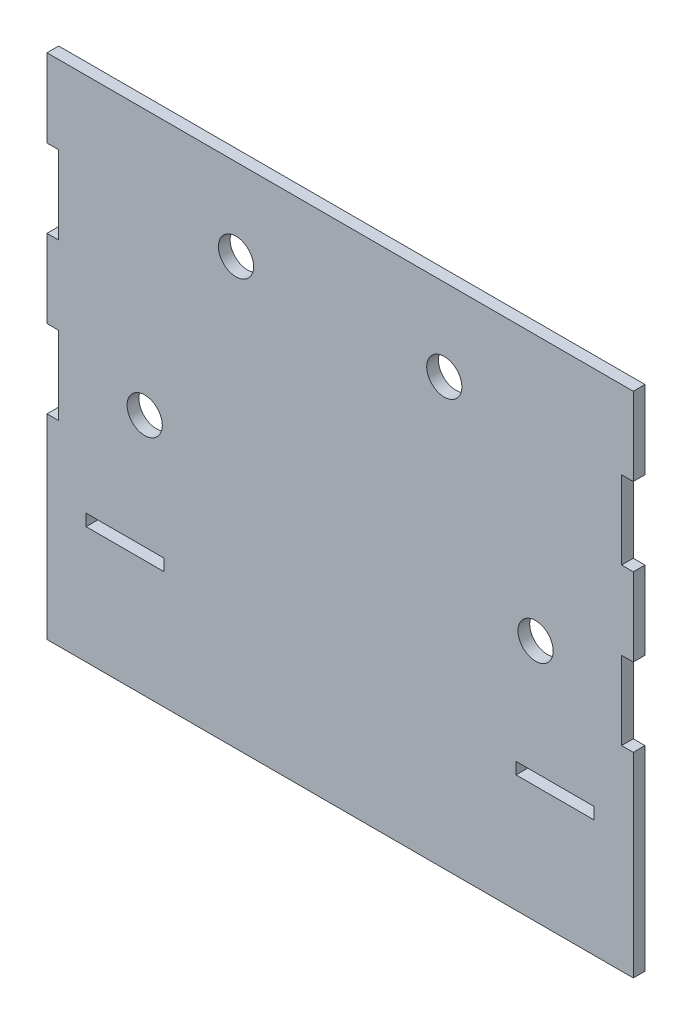
ISO-10303-21;
HEADER;
FILE_DESCRIPTION(('STEP AP214'),'2;1');
FILE_NAME('part.step','',(''),(''),'','','');
FILE_SCHEMA(('AUTOMOTIVE_DESIGN { 1 0 10303 214 1 1 1 1 }'));
ENDSEC;
DATA;
#1=APPLICATION_CONTEXT('core data for automotive mechanical design processes');
#2=APPLICATION_PROTOCOL_DEFINITION('international standard','automotive_design',2000,#1);
#3=PRODUCT_CONTEXT('',#1,'mechanical');
#4=PRODUCT('Part','Part','',(#3));
#5=PRODUCT_RELATED_PRODUCT_CATEGORY('part','',(#4));
#6=PRODUCT_DEFINITION_FORMATION('','',#4);
#7=PRODUCT_DEFINITION_CONTEXT('part definition',#1,'design');
#8=PRODUCT_DEFINITION('design','',#6,#7);
#9=PRODUCT_DEFINITION_SHAPE('','',#8);
#10=(LENGTH_UNIT() NAMED_UNIT(*) SI_UNIT(.MILLI.,.METRE.));
#11=(NAMED_UNIT(*) PLANE_ANGLE_UNIT() SI_UNIT($,.RADIAN.));
#12=(NAMED_UNIT(*) SI_UNIT($,.STERADIAN.) SOLID_ANGLE_UNIT());
#13=UNCERTAINTY_MEASURE_WITH_UNIT(LENGTH_MEASURE(1.E-05),#10,'distance_accuracy_value','');
#14=(GEOMETRIC_REPRESENTATION_CONTEXT(3) GLOBAL_UNCERTAINTY_ASSIGNED_CONTEXT((#13)) GLOBAL_UNIT_ASSIGNED_CONTEXT((#10,
#11,#12)) REPRESENTATION_CONTEXT('',''));
#15=CARTESIAN_POINT('',(0.,0.,0.));
#16=DIRECTION('',(0.,0.,1.));
#17=DIRECTION('',(1.,0.,0.));
#18=AXIS2_PLACEMENT_3D('',#15,#16,#17);
#19=CARTESIAN_POINT('',(75.,-50.,3.));
#20=DIRECTION('',(-1.,0.,0.));
#21=DIRECTION('',(0.,0.,1.));
#22=AXIS2_PLACEMENT_3D('',#19,#20,#21);
#23=PLANE('',#22);
#24=DIRECTION('',(0.,1.,0.));
#25=VECTOR('',#24,1.);
#26=CARTESIAN_POINT('',(75.,-50.,0.));
#27=LINE('',#26,#25);
#28=CARTESIAN_POINT('',(75.,-80.,0.));
#29=VERTEX_POINT('',#28);
#30=CARTESIAN_POINT('',(75.,-30.,0.));
#31=VERTEX_POINT('',#30);
#32=EDGE_CURVE('E246',#29,#31,#27,.T.);
#33=ORIENTED_EDGE('',*,*,#32,.T.);
#34=DIRECTION('',(0.,0.,1.));
#35=VECTOR('',#34,1.);
#36=CARTESIAN_POINT('',(75.,-30.,0.));
#37=LINE('',#36,#35);
#38=CARTESIAN_POINT('',(75.,-30.,3.));
#39=VERTEX_POINT('',#38);
#40=EDGE_CURVE('E333',#31,#39,#37,.T.);
#41=ORIENTED_EDGE('',*,*,#40,.T.);
#42=DIRECTION('',(0.,1.,0.));
#43=VECTOR('',#42,1.);
#44=CARTESIAN_POINT('',(75.,-50.,3.));
#45=LINE('',#44,#43);
#46=CARTESIAN_POINT('',(75.,-80.,3.));
#47=VERTEX_POINT('',#46);
#48=EDGE_CURVE('E424',#47,#39,#45,.T.);
#49=ORIENTED_EDGE('',*,*,#48,.F.);
#50=DIRECTION('',(0.,0.,1.));
#51=VECTOR('',#50,1.);
#52=CARTESIAN_POINT('',(75.,-80.,3.));
#53=LINE('',#52,#51);
#54=EDGE_CURVE('E250',#29,#47,#53,.T.);
#55=ORIENTED_EDGE('',*,*,#54,.F.);
#56=EDGE_LOOP('',(#33,#41,#49,#55));
#57=FACE_BOUND('',#56,.T.);
#58=ADVANCED_FACE('F39',(#57),#23,.F.);
#59=CARTESIAN_POINT('',(75.,-10.,3.));
#60=VERTEX_POINT('',#59);
#61=CARTESIAN_POINT('',(75.,9.99999999999999,3.));
#62=VERTEX_POINT('',#61);
#63=EDGE_CURVE('E428',#60,#62,#45,.T.);
#64=ORIENTED_EDGE('',*,*,#63,.F.);
#65=DIRECTION('',(0.,0.,1.));
#66=VECTOR('',#65,1.);
#67=CARTESIAN_POINT('',(75.,-10.,0.));
#68=LINE('',#67,#66);
#69=CARTESIAN_POINT('',(75.,-10.,0.));
#70=VERTEX_POINT('',#69);
#71=EDGE_CURVE('E326',#70,#60,#68,.T.);
#72=ORIENTED_EDGE('',*,*,#71,.F.);
#73=CARTESIAN_POINT('',(75.,9.99999999999999,0.));
#74=VERTEX_POINT('',#73);
#75=EDGE_CURVE('E437',#70,#74,#27,.T.);
#76=ORIENTED_EDGE('',*,*,#75,.T.);
#77=DIRECTION('',(0.,0.,1.));
#78=VECTOR('',#77,1.);
#79=CARTESIAN_POINT('',(75.,9.99999999999999,0.));
#80=LINE('',#79,#78);
#81=EDGE_CURVE('E415',#74,#62,#80,.T.);
#82=ORIENTED_EDGE('',*,*,#81,.T.);
#83=EDGE_LOOP('',(#64,#72,#76,#82));
#84=FACE_BOUND('',#83,.T.);
#85=ADVANCED_FACE('F491',(#84),#23,.F.);
#86=CARTESIAN_POINT('',(-75.,-50.,3.));
#87=DIRECTION('',(1.,0.,0.));
#88=DIRECTION('',(0.,0.,-1.));
#89=AXIS2_PLACEMENT_3D('',#86,#87,#88);
#90=PLANE('',#89);
#91=DIRECTION('',(0.,-1.,0.));
#92=VECTOR('',#91,1.);
#93=CARTESIAN_POINT('',(-75.,-50.,0.));
#94=LINE('',#93,#92);
#95=CARTESIAN_POINT('',(-75.,50.,0.));
#96=VERTEX_POINT('',#95);
#97=CARTESIAN_POINT('',(-75.,30.,0.));
#98=VERTEX_POINT('',#97);
#99=EDGE_CURVE('E239',#96,#98,#94,.T.);
#100=ORIENTED_EDGE('',*,*,#99,.T.);
#101=DIRECTION('',(0.,0.,1.));
#102=VECTOR('',#101,1.);
#103=CARTESIAN_POINT('',(-75.,30.,0.));
#104=LINE('',#103,#102);
#105=CARTESIAN_POINT('',(-75.,30.,3.));
#106=VERTEX_POINT('',#105);
#107=EDGE_CURVE('E376',#98,#106,#104,.T.);
#108=ORIENTED_EDGE('',*,*,#107,.T.);
#109=DIRECTION('',(0.,-1.,0.));
#110=VECTOR('',#109,1.);
#111=CARTESIAN_POINT('',(-75.,-50.,3.));
#112=LINE('',#111,#110);
#113=CARTESIAN_POINT('',(-75.,50.,3.));
#114=VERTEX_POINT('',#113);
#115=EDGE_CURVE('E432',#114,#106,#112,.T.);
#116=ORIENTED_EDGE('',*,*,#115,.F.);
#117=DIRECTION('',(0.,0.,-1.));
#118=VECTOR('',#117,1.);
#119=CARTESIAN_POINT('',(-75.,50.,3.));
#120=LINE('',#119,#118);
#121=EDGE_CURVE('E48',#114,#96,#120,.T.);
#122=ORIENTED_EDGE('',*,*,#121,.T.);
#123=EDGE_LOOP('',(#100,#108,#116,#122));
#124=FACE_BOUND('',#123,.T.);
#125=ADVANCED_FACE('F496',(#124),#90,.F.);
#126=CARTESIAN_POINT('',(-75.,9.99999999999999,3.));
#127=VERTEX_POINT('',#126);
#128=CARTESIAN_POINT('',(-75.,-10.,3.));
#129=VERTEX_POINT('',#128);
#130=EDGE_CURVE('E435',#127,#129,#112,.T.);
#131=ORIENTED_EDGE('',*,*,#130,.F.);
#132=DIRECTION('',(0.,0.,1.));
#133=VECTOR('',#132,1.);
#134=CARTESIAN_POINT('',(-75.,9.99999999999999,0.));
#135=LINE('',#134,#133);
#136=CARTESIAN_POINT('',(-75.,9.99999999999999,0.));
#137=VERTEX_POINT('',#136);
#138=EDGE_CURVE('E379',#137,#127,#135,.T.);
#139=ORIENTED_EDGE('',*,*,#138,.F.);
#140=CARTESIAN_POINT('',(-75.,-10.,0.));
#141=VERTEX_POINT('',#140);
#142=EDGE_CURVE('E236',#137,#141,#94,.T.);
#143=ORIENTED_EDGE('',*,*,#142,.T.);
#144=DIRECTION('',(0.,0.,1.));
#145=VECTOR('',#144,1.);
#146=CARTESIAN_POINT('',(-75.,-10.,0.));
#147=LINE('',#146,#145);
#148=EDGE_CURVE('E302',#141,#129,#147,.T.);
#149=ORIENTED_EDGE('',*,*,#148,.T.);
#150=EDGE_LOOP('',(#131,#139,#143,#149));
#151=FACE_BOUND('',#150,.T.);
#152=ADVANCED_FACE('F500',(#151),#90,.F.);
#153=CARTESIAN_POINT('',(75.,30.,3.));
#154=VERTEX_POINT('',#153);
#155=CARTESIAN_POINT('',(75.,50.,3.));
#156=VERTEX_POINT('',#155);
#157=EDGE_CURVE('E429',#154,#156,#45,.T.);
#158=ORIENTED_EDGE('',*,*,#157,.F.);
#159=DIRECTION('',(0.,0.,1.));
#160=VECTOR('',#159,1.);
#161=CARTESIAN_POINT('',(75.,30.,0.));
#162=LINE('',#161,#160);
#163=CARTESIAN_POINT('',(75.,30.,0.));
#164=VERTEX_POINT('',#163);
#165=EDGE_CURVE('E408',#164,#154,#162,.T.);
#166=ORIENTED_EDGE('',*,*,#165,.F.);
#167=CARTESIAN_POINT('',(75.,50.,0.));
#168=VERTEX_POINT('',#167);
#169=EDGE_CURVE('E418',#164,#168,#27,.T.);
#170=ORIENTED_EDGE('',*,*,#169,.T.);
#171=DIRECTION('',(0.,0.,-1.));
#172=VECTOR('',#171,1.);
#173=CARTESIAN_POINT('',(75.,50.,3.));
#174=LINE('',#173,#172);
#175=EDGE_CURVE('E11',#156,#168,#174,.T.);
#176=ORIENTED_EDGE('',*,*,#175,.F.);
#177=EDGE_LOOP('',(#158,#166,#170,#176));
#178=FACE_BOUND('',#177,.T.);
#179=ADVANCED_FACE('F41',(#178),#23,.F.);
#180=CARTESIAN_POINT('',(-75.,50.,3.));
#181=DIRECTION('',(0.,-1.,0.));
#182=DIRECTION('',(0.,0.,-1.));
#183=AXIS2_PLACEMENT_3D('',#180,#181,#182);
#184=PLANE('',#183);
#185=DIRECTION('',(-1.,0.,0.));
#186=VECTOR('',#185,1.);
#187=CARTESIAN_POINT('',(-75.,50.,0.));
#188=LINE('',#187,#186);
#189=EDGE_CURVE('E237',#168,#96,#188,.T.);
#190=ORIENTED_EDGE('',*,*,#189,.T.);
#191=ORIENTED_EDGE('',*,*,#121,.F.);
#192=DIRECTION('',(-1.,0.,0.));
#193=VECTOR('',#192,1.);
#194=CARTESIAN_POINT('',(-75.,50.,3.));
#195=LINE('',#194,#193);
#196=EDGE_CURVE('E427',#156,#114,#195,.T.);
#197=ORIENTED_EDGE('',*,*,#196,.F.);
#198=ORIENTED_EDGE('',*,*,#175,.T.);
#199=EDGE_LOOP('',(#190,#191,#197,#198));
#200=FACE_BOUND('',#199,.T.);
#201=ADVANCED_FACE('F499',(#200),#184,.F.);
#202=CARTESIAN_POINT('',(-75.,-30.,3.));
#203=VERTEX_POINT('',#202);
#204=CARTESIAN_POINT('',(-75.,-80.,3.));
#205=VERTEX_POINT('',#204);
#206=EDGE_CURVE('E431',#203,#205,#112,.T.);
#207=ORIENTED_EDGE('',*,*,#206,.F.);
#208=DIRECTION('',(0.,0.,1.));
#209=VECTOR('',#208,1.);
#210=CARTESIAN_POINT('',(-75.,-30.,0.));
#211=LINE('',#210,#209);
#212=CARTESIAN_POINT('',(-75.,-30.,0.));
#213=VERTEX_POINT('',#212);
#214=EDGE_CURVE('E233',#213,#203,#211,.T.);
#215=ORIENTED_EDGE('',*,*,#214,.F.);
#216=CARTESIAN_POINT('',(-75.,-80.,0.));
#217=VERTEX_POINT('',#216);
#218=EDGE_CURVE('E227',#213,#217,#94,.T.);
#219=ORIENTED_EDGE('',*,*,#218,.T.);
#220=DIRECTION('',(0.,0.,-1.));
#221=VECTOR('',#220,1.);
#222=CARTESIAN_POINT('',(-75.,-80.,3.));
#223=LINE('',#222,#221);
#224=EDGE_CURVE('E232',#205,#217,#223,.T.);
#225=ORIENTED_EDGE('',*,*,#224,.F.);
#226=EDGE_LOOP('',(#207,#215,#219,#225));
#227=FACE_BOUND('',#226,.T.);
#228=ADVANCED_FACE('F230',(#227),#90,.F.);
#229=CARTESIAN_POINT('',(0.,0.,3.));
#230=DIRECTION('',(0.,0.,-1.));
#231=DIRECTION('',(-1.,0.,0.));
#232=AXIS2_PLACEMENT_3D('',#229,#230,#231);
#233=PLANE('',#232);
#234=CARTESIAN_POINT('',(-26.6440677966097,29.0267849830182,3.));
#235=DIRECTION('',(0.,0.,-1.));
#236=DIRECTION('',(-1.,0.,0.));
#237=AXIS2_PLACEMENT_3D('',#234,#235,#236);
#238=CIRCLE('',#237,4.49999999999964);
#239=CARTESIAN_POINT('',(-31.1440677966093,29.0267849830182,3.));
#240=VERTEX_POINT('',#239);
#241=EDGE_CURVE('E451',#240,#240,#238,.T.);
#242=ORIENTED_EDGE('',*,*,#241,.T.);
#243=EDGE_LOOP('',(#242));
#244=FACE_BOUND('',#243,.T.);
#245=CARTESIAN_POINT('',(26.6440677966106,29.0267849830176,3.));
#246=DIRECTION('',(0.,0.,-1.));
#247=DIRECTION('',(-1.,0.,0.));
#248=AXIS2_PLACEMENT_3D('',#245,#246,#247);
#249=CIRCLE('',#248,4.49999999999965);
#250=CARTESIAN_POINT('',(22.144067796611,29.0267849830176,3.));
#251=VERTEX_POINT('',#250);
#252=EDGE_CURVE('E455',#251,#251,#249,.T.);
#253=ORIENTED_EDGE('',*,*,#252,.T.);
#254=EDGE_LOOP('',(#253));
#255=FACE_BOUND('',#254,.T.);
#256=CARTESIAN_POINT('',(49.9999999999923,-17.807715926452,3.));
#257=DIRECTION('',(0.,0.,1.));
#258=DIRECTION('',(1.,0.,0.));
#259=AXIS2_PLACEMENT_3D('',#256,#257,#258);
#260=CIRCLE('',#259,4.4999999999935);
#261=CARTESIAN_POINT('',(54.4999999999858,-17.807715926452,3.));
#262=VERTEX_POINT('',#261);
#263=EDGE_CURVE('E443',#262,#262,#260,.T.);
#264=ORIENTED_EDGE('',*,*,#263,.F.);
#265=EDGE_LOOP('',(#264));
#266=FACE_BOUND('',#265,.T.);
#267=CARTESIAN_POINT('',(-50.0000000000077,-17.8077159264507,3.));
#268=DIRECTION('',(0.,0.,1.));
#269=DIRECTION('',(1.,0.,0.));
#270=AXIS2_PLACEMENT_3D('',#267,#268,#269);
#271=CIRCLE('',#270,4.5);
#272=CARTESIAN_POINT('',(-45.5000000000077,-17.8077159264507,3.));
#273=VERTEX_POINT('',#272);
#274=EDGE_CURVE('E262',#273,#273,#271,.T.);
#275=ORIENTED_EDGE('',*,*,#274,.F.);
#276=EDGE_LOOP('',(#275));
#277=FACE_BOUND('',#276,.T.);
#278=DIRECTION('',(-1.,0.,0.));
#279=VECTOR('',#278,1.);
#280=CARTESIAN_POINT('',(-75.,-80.,3.));
#281=LINE('',#280,#279);
#282=EDGE_CURVE('E255',#47,#205,#281,.T.);
#283=ORIENTED_EDGE('',*,*,#282,.F.);
#284=ORIENTED_EDGE('',*,*,#48,.T.);
#285=DIRECTION('',(1.,0.,0.));
#286=VECTOR('',#285,1.);
#287=CARTESIAN_POINT('',(72.,-30.,3.));
#288=LINE('',#287,#286);
#289=CARTESIAN_POINT('',(72.,-30.,3.));
#290=VERTEX_POINT('',#289);
#291=EDGE_CURVE('E337',#290,#39,#288,.T.);
#292=ORIENTED_EDGE('',*,*,#291,.F.);
#293=DIRECTION('',(0.,-1.,0.));
#294=VECTOR('',#293,1.);
#295=CARTESIAN_POINT('',(72.,-10.,3.));
#296=LINE('',#295,#294);
#297=CARTESIAN_POINT('',(72.,-10.,3.));
#298=VERTEX_POINT('',#297);
#299=EDGE_CURVE('E339',#298,#290,#296,.T.);
#300=ORIENTED_EDGE('',*,*,#299,.F.);
#301=DIRECTION('',(-1.,0.,0.));
#302=VECTOR('',#301,1.);
#303=CARTESIAN_POINT('',(75.,-10.,3.));
#304=LINE('',#303,#302);
#305=EDGE_CURVE('E343',#60,#298,#304,.T.);
#306=ORIENTED_EDGE('',*,*,#305,.F.);
#307=ORIENTED_EDGE('',*,*,#63,.T.);
#308=DIRECTION('',(1.,0.,0.));
#309=VECTOR('',#308,1.);
#310=CARTESIAN_POINT('',(72.,10.,3.));
#311=LINE('',#310,#309);
#312=CARTESIAN_POINT('',(72.,10.,3.));
#313=VERTEX_POINT('',#312);
#314=EDGE_CURVE('E402',#313,#62,#311,.T.);
#315=ORIENTED_EDGE('',*,*,#314,.F.);
#316=DIRECTION('',(0.,-1.,0.));
#317=VECTOR('',#316,1.);
#318=CARTESIAN_POINT('',(72.,30.,3.));
#319=LINE('',#318,#317);
#320=CARTESIAN_POINT('',(72.,30.,3.));
#321=VERTEX_POINT('',#320);
#322=EDGE_CURVE('E411',#321,#313,#319,.T.);
#323=ORIENTED_EDGE('',*,*,#322,.F.);
#324=DIRECTION('',(-1.,0.,0.));
#325=VECTOR('',#324,1.);
#326=CARTESIAN_POINT('',(75.,30.,3.));
#327=LINE('',#326,#325);
#328=EDGE_CURVE('E346',#154,#321,#327,.T.);
#329=ORIENTED_EDGE('',*,*,#328,.F.);
#330=ORIENTED_EDGE('',*,*,#157,.T.);
#331=ORIENTED_EDGE('',*,*,#196,.T.);
#332=ORIENTED_EDGE('',*,*,#115,.T.);
#333=DIRECTION('',(-1.,0.,0.));
#334=VECTOR('',#333,1.);
#335=CARTESIAN_POINT('',(-75.,30.,3.));
#336=LINE('',#335,#334);
#337=CARTESIAN_POINT('',(-72.,30.,3.));
#338=VERTEX_POINT('',#337);
#339=EDGE_CURVE('E311',#338,#106,#336,.T.);
#340=ORIENTED_EDGE('',*,*,#339,.F.);
#341=DIRECTION('',(0.,1.,0.));
#342=VECTOR('',#341,1.);
#343=CARTESIAN_POINT('',(-72.,30.,3.));
#344=LINE('',#343,#342);
#345=CARTESIAN_POINT('',(-72.,10.,3.));
#346=VERTEX_POINT('',#345);
#347=EDGE_CURVE('E384',#346,#338,#344,.T.);
#348=ORIENTED_EDGE('',*,*,#347,.F.);
#349=DIRECTION('',(1.,0.,0.));
#350=VECTOR('',#349,1.);
#351=CARTESIAN_POINT('',(-72.,10.,3.));
#352=LINE('',#351,#350);
#353=EDGE_CURVE('E387',#127,#346,#352,.T.);
#354=ORIENTED_EDGE('',*,*,#353,.F.);
#355=ORIENTED_EDGE('',*,*,#130,.T.);
#356=DIRECTION('',(-1.,0.,0.));
#357=VECTOR('',#356,1.);
#358=CARTESIAN_POINT('',(-75.,-10.,3.));
#359=LINE('',#358,#357);
#360=CARTESIAN_POINT('',(-72.,-10.,3.));
#361=VERTEX_POINT('',#360);
#362=EDGE_CURVE('E283',#361,#129,#359,.T.);
#363=ORIENTED_EDGE('',*,*,#362,.F.);
#364=DIRECTION('',(0.,1.,0.));
#365=VECTOR('',#364,1.);
#366=CARTESIAN_POINT('',(-72.,-10.,3.));
#367=LINE('',#366,#365);
#368=CARTESIAN_POINT('',(-72.,-30.,3.));
#369=VERTEX_POINT('',#368);
#370=EDGE_CURVE('E312',#369,#361,#367,.T.);
#371=ORIENTED_EDGE('',*,*,#370,.F.);
#372=DIRECTION('',(1.,0.,0.));
#373=VECTOR('',#372,1.);
#374=CARTESIAN_POINT('',(-72.,-30.,3.));
#375=LINE('',#374,#373);
#376=EDGE_CURVE('E315',#203,#369,#375,.T.);
#377=ORIENTED_EDGE('',*,*,#376,.F.);
#378=ORIENTED_EDGE('',*,*,#206,.T.);
#379=EDGE_LOOP('',(#283,#284,#292,#300,#306,#307,#315,#323,#329,#330,#331,#332,#340,#348,#354,
#355,#363,#371,#377,#378));
#380=FACE_BOUND('',#379,.T.);
#381=DIRECTION('',(-1.,0.,0.));
#382=VECTOR('',#381,1.);
#383=CARTESIAN_POINT('',(-75.,-50.,3.));
#384=LINE('',#383,#382);
#385=CARTESIAN_POINT('',(65.,-50.,3.));
#386=VERTEX_POINT('',#385);
#387=CARTESIAN_POINT('',(45.,-50.,3.));
#388=VERTEX_POINT('',#387);
#389=EDGE_CURVE('E256',#386,#388,#384,.T.);
#390=ORIENTED_EDGE('',*,*,#389,.T.);
#391=DIRECTION('',(0.,-1.,0.));
#392=VECTOR('',#391,1.);
#393=CARTESIAN_POINT('',(45.,-50.,3.));
#394=LINE('',#393,#392);
#395=CARTESIAN_POINT('',(45.,-47.,3.));
#396=VERTEX_POINT('',#395);
#397=EDGE_CURVE('E291',#396,#388,#394,.T.);
#398=ORIENTED_EDGE('',*,*,#397,.F.);
#399=DIRECTION('',(-1.,0.,0.));
#400=VECTOR('',#399,1.);
#401=CARTESIAN_POINT('',(45.,-47.,3.));
#402=LINE('',#401,#400);
#403=CARTESIAN_POINT('',(65.,-47.,3.));
#404=VERTEX_POINT('',#403);
#405=EDGE_CURVE('E284',#404,#396,#402,.T.);
#406=ORIENTED_EDGE('',*,*,#405,.F.);
#407=DIRECTION('',(0.,1.,0.));
#408=VECTOR('',#407,1.);
#409=CARTESIAN_POINT('',(65.,-50.,3.));
#410=LINE('',#409,#408);
#411=EDGE_CURVE('E287',#386,#404,#410,.T.);
#412=ORIENTED_EDGE('',*,*,#411,.F.);
#413=EDGE_LOOP('',(#390,#398,#406,#412));
#414=FACE_BOUND('',#413,.T.);
#415=DIRECTION('',(0.,1.,0.));
#416=VECTOR('',#415,1.);
#417=CARTESIAN_POINT('',(-45.,-50.,3.));
#418=LINE('',#417,#416);
#419=CARTESIAN_POINT('',(-45.,-50.,3.));
#420=VERTEX_POINT('',#419);
#421=CARTESIAN_POINT('',(-45.,-47.,3.));
#422=VERTEX_POINT('',#421);
#423=EDGE_CURVE('E364',#420,#422,#418,.T.);
#424=ORIENTED_EDGE('',*,*,#423,.F.);
#425=CARTESIAN_POINT('',(-65.,-50.,3.));
#426=VERTEX_POINT('',#425);
#427=EDGE_CURVE('E259',#420,#426,#384,.T.);
#428=ORIENTED_EDGE('',*,*,#427,.T.);
#429=DIRECTION('',(0.,-1.,0.));
#430=VECTOR('',#429,1.);
#431=CARTESIAN_POINT('',(-65.,-50.,3.));
#432=LINE('',#431,#430);
#433=CARTESIAN_POINT('',(-65.,-47.,3.));
#434=VERTEX_POINT('',#433);
#435=EDGE_CURVE('E336',#434,#426,#432,.T.);
#436=ORIENTED_EDGE('',*,*,#435,.F.);
#437=DIRECTION('',(-1.,0.,0.));
#438=VECTOR('',#437,1.);
#439=CARTESIAN_POINT('',(-65.,-47.,3.));
#440=LINE('',#439,#438);
#441=EDGE_CURVE('E361',#422,#434,#440,.T.);
#442=ORIENTED_EDGE('',*,*,#441,.F.);
#443=EDGE_LOOP('',(#424,#428,#436,#442));
#444=FACE_BOUND('',#443,.T.);
#445=ADVANCED_FACE('F471',(#244,#255,#266,#277,#380,#414,#444),#233,.F.);
#446=CARTESIAN_POINT('',(0.,0.,0.));
#447=DIRECTION('',(0.,0.,-1.));
#448=DIRECTION('',(-1.,0.,0.));
#449=AXIS2_PLACEMENT_3D('',#446,#447,#448);
#450=PLANE('',#449);
#451=CARTESIAN_POINT('',(-26.6440677966097,29.0267849830182,0.));
#452=DIRECTION('',(0.,0.,-1.));
#453=DIRECTION('',(-1.,0.,0.));
#454=AXIS2_PLACEMENT_3D('',#451,#452,#453);
#455=CIRCLE('',#454,4.49999999999964);
#456=CARTESIAN_POINT('',(-31.1440677966093,29.0267849830182,0.));
#457=VERTEX_POINT('',#456);
#458=EDGE_CURVE('E458',#457,#457,#455,.T.);
#459=ORIENTED_EDGE('',*,*,#458,.F.);
#460=EDGE_LOOP('',(#459));
#461=FACE_BOUND('',#460,.T.);
#462=CARTESIAN_POINT('',(26.6440677966106,29.0267849830176,0.));
#463=DIRECTION('',(0.,0.,-1.));
#464=DIRECTION('',(-1.,0.,0.));
#465=AXIS2_PLACEMENT_3D('',#462,#463,#464);
#466=CIRCLE('',#465,4.49999999999965);
#467=CARTESIAN_POINT('',(22.144067796611,29.0267849830176,0.));
#468=VERTEX_POINT('',#467);
#469=EDGE_CURVE('E459',#468,#468,#466,.T.);
#470=ORIENTED_EDGE('',*,*,#469,.F.);
#471=EDGE_LOOP('',(#470));
#472=FACE_BOUND('',#471,.T.);
#473=CARTESIAN_POINT('',(49.9999999999923,-17.807715926452,0.));
#474=DIRECTION('',(0.,0.,-1.));
#475=DIRECTION('',(-1.,0.,0.));
#476=AXIS2_PLACEMENT_3D('',#473,#474,#475);
#477=CIRCLE('',#476,4.4999999999935);
#478=CARTESIAN_POINT('',(45.4999999999988,-17.807715926452,0.));
#479=VERTEX_POINT('',#478);
#480=EDGE_CURVE('E43',#479,#479,#477,.T.);
#481=ORIENTED_EDGE('',*,*,#480,.F.);
#482=EDGE_LOOP('',(#481));
#483=FACE_BOUND('',#482,.T.);
#484=CARTESIAN_POINT('',(-50.0000000000077,-17.8077159264507,0.));
#485=DIRECTION('',(0.,0.,-1.));
#486=DIRECTION('',(-1.,0.,0.));
#487=AXIS2_PLACEMENT_3D('',#484,#485,#486);
#488=CIRCLE('',#487,4.5);
#489=CARTESIAN_POINT('',(-54.5000000000077,-17.8077159264507,0.));
#490=VERTEX_POINT('',#489);
#491=EDGE_CURVE('E441',#490,#490,#488,.T.);
#492=ORIENTED_EDGE('',*,*,#491,.F.);
#493=EDGE_LOOP('',(#492));
#494=FACE_BOUND('',#493,.T.);
#495=ORIENTED_EDGE('',*,*,#32,.F.);
#496=DIRECTION('',(1.,0.,0.));
#497=VECTOR('',#496,1.);
#498=CARTESIAN_POINT('',(-75.,-80.,0.));
#499=LINE('',#498,#497);
#500=EDGE_CURVE('E241',#217,#29,#499,.T.);
#501=ORIENTED_EDGE('',*,*,#500,.F.);
#502=ORIENTED_EDGE('',*,*,#218,.F.);
#503=DIRECTION('',(1.,0.,0.));
#504=VECTOR('',#503,1.);
#505=CARTESIAN_POINT('',(-72.,-30.,0.));
#506=LINE('',#505,#504);
#507=CARTESIAN_POINT('',(-72.,-30.,0.));
#508=VERTEX_POINT('',#507);
#509=EDGE_CURVE('E322',#213,#508,#506,.T.);
#510=ORIENTED_EDGE('',*,*,#509,.T.);
#511=DIRECTION('',(0.,1.,0.));
#512=VECTOR('',#511,1.);
#513=CARTESIAN_POINT('',(-72.,-10.,0.));
#514=LINE('',#513,#512);
#515=CARTESIAN_POINT('',(-72.,-10.,0.));
#516=VERTEX_POINT('',#515);
#517=EDGE_CURVE('E305',#508,#516,#514,.T.);
#518=ORIENTED_EDGE('',*,*,#517,.T.);
#519=DIRECTION('',(-1.,0.,0.));
#520=VECTOR('',#519,1.);
#521=CARTESIAN_POINT('',(-75.,-10.,0.));
#522=LINE('',#521,#520);
#523=EDGE_CURVE('E316',#516,#141,#522,.T.);
#524=ORIENTED_EDGE('',*,*,#523,.T.);
#525=ORIENTED_EDGE('',*,*,#142,.F.);
#526=DIRECTION('',(1.,0.,0.));
#527=VECTOR('',#526,1.);
#528=CARTESIAN_POINT('',(-72.,10.,0.));
#529=LINE('',#528,#527);
#530=CARTESIAN_POINT('',(-72.,10.,0.));
#531=VERTEX_POINT('',#530);
#532=EDGE_CURVE('E393',#137,#531,#529,.T.);
#533=ORIENTED_EDGE('',*,*,#532,.T.);
#534=DIRECTION('',(0.,1.,0.));
#535=VECTOR('',#534,1.);
#536=CARTESIAN_POINT('',(-72.,30.,0.));
#537=LINE('',#536,#535);
#538=CARTESIAN_POINT('',(-72.,30.,0.));
#539=VERTEX_POINT('',#538);
#540=EDGE_CURVE('E56',#531,#539,#537,.T.);
#541=ORIENTED_EDGE('',*,*,#540,.T.);
#542=DIRECTION('',(-1.,0.,0.));
#543=VECTOR('',#542,1.);
#544=CARTESIAN_POINT('',(-75.,30.,0.));
#545=LINE('',#544,#543);
#546=EDGE_CURVE('E388',#539,#98,#545,.T.);
#547=ORIENTED_EDGE('',*,*,#546,.T.);
#548=ORIENTED_EDGE('',*,*,#99,.F.);
#549=ORIENTED_EDGE('',*,*,#189,.F.);
#550=ORIENTED_EDGE('',*,*,#169,.F.);
#551=DIRECTION('',(-1.,0.,0.));
#552=VECTOR('',#551,1.);
#553=CARTESIAN_POINT('',(75.,30.,0.));
#554=LINE('',#553,#552);
#555=CARTESIAN_POINT('',(72.,30.,0.));
#556=VERTEX_POINT('',#555);
#557=EDGE_CURVE('E398',#164,#556,#554,.T.);
#558=ORIENTED_EDGE('',*,*,#557,.T.);
#559=DIRECTION('',(0.,-1.,0.));
#560=VECTOR('',#559,1.);
#561=CARTESIAN_POINT('',(72.,30.,0.));
#562=LINE('',#561,#560);
#563=CARTESIAN_POINT('',(72.,10.,0.));
#564=VERTEX_POINT('',#563);
#565=EDGE_CURVE('E401',#556,#564,#562,.T.);
#566=ORIENTED_EDGE('',*,*,#565,.T.);
#567=DIRECTION('',(1.,0.,0.));
#568=VECTOR('',#567,1.);
#569=CARTESIAN_POINT('',(72.,10.,0.));
#570=LINE('',#569,#568);
#571=EDGE_CURVE('E405',#564,#74,#570,.T.);
#572=ORIENTED_EDGE('',*,*,#571,.T.);
#573=ORIENTED_EDGE('',*,*,#75,.F.);
#574=DIRECTION('',(-1.,0.,0.));
#575=VECTOR('',#574,1.);
#576=CARTESIAN_POINT('',(75.,-10.,0.));
#577=LINE('',#576,#575);
#578=CARTESIAN_POINT('',(72.,-10.,0.));
#579=VERTEX_POINT('',#578);
#580=EDGE_CURVE('E340',#70,#579,#577,.T.);
#581=ORIENTED_EDGE('',*,*,#580,.T.);
#582=DIRECTION('',(0.,-1.,0.));
#583=VECTOR('',#582,1.);
#584=CARTESIAN_POINT('',(72.,-10.,0.));
#585=LINE('',#584,#583);
#586=CARTESIAN_POINT('',(72.,-30.,0.));
#587=VERTEX_POINT('',#586);
#588=EDGE_CURVE('E64',#579,#587,#585,.T.);
#589=ORIENTED_EDGE('',*,*,#588,.T.);
#590=DIRECTION('',(1.,0.,0.));
#591=VECTOR('',#590,1.);
#592=CARTESIAN_POINT('',(72.,-30.,0.));
#593=LINE('',#592,#591);
#594=EDGE_CURVE('E328',#587,#31,#593,.T.);
#595=ORIENTED_EDGE('',*,*,#594,.T.);
#596=EDGE_LOOP('',(#495,#501,#502,#510,#518,#524,#525,#533,#541,#547,#548,#549,#550,#558,#566,
#572,#573,#581,#589,#595));
#597=FACE_BOUND('',#596,.T.);
#598=DIRECTION('',(0.,-1.,0.));
#599=VECTOR('',#598,1.);
#600=CARTESIAN_POINT('',(45.,-50.,0.));
#601=LINE('',#600,#599);
#602=CARTESIAN_POINT('',(45.,-47.,0.));
#603=VERTEX_POINT('',#602);
#604=CARTESIAN_POINT('',(45.,-50.,0.));
#605=VERTEX_POINT('',#604);
#606=EDGE_CURVE('E288',#603,#605,#601,.T.);
#607=ORIENTED_EDGE('',*,*,#606,.T.);
#608=DIRECTION('',(1.,0.,0.));
#609=VECTOR('',#608,1.);
#610=CARTESIAN_POINT('',(-75.,-50.,0.));
#611=LINE('',#610,#609);
#612=CARTESIAN_POINT('',(65.,-50.,0.));
#613=VERTEX_POINT('',#612);
#614=EDGE_CURVE('E268',#605,#613,#611,.T.);
#615=ORIENTED_EDGE('',*,*,#614,.T.);
#616=DIRECTION('',(0.,1.,0.));
#617=VECTOR('',#616,1.);
#618=CARTESIAN_POINT('',(65.,-50.,0.));
#619=LINE('',#618,#617);
#620=CARTESIAN_POINT('',(65.,-47.,0.));
#621=VERTEX_POINT('',#620);
#622=EDGE_CURVE('E297',#613,#621,#619,.T.);
#623=ORIENTED_EDGE('',*,*,#622,.T.);
#624=DIRECTION('',(-1.,0.,0.));
#625=VECTOR('',#624,1.);
#626=CARTESIAN_POINT('',(45.,-47.,0.));
#627=LINE('',#626,#625);
#628=EDGE_CURVE('E275',#621,#603,#627,.T.);
#629=ORIENTED_EDGE('',*,*,#628,.T.);
#630=EDGE_LOOP('',(#607,#615,#623,#629));
#631=FACE_BOUND('',#630,.T.);
#632=CARTESIAN_POINT('',(-65.,-50.,0.));
#633=VERTEX_POINT('',#632);
#634=CARTESIAN_POINT('',(-45.,-50.,0.));
#635=VERTEX_POINT('',#634);
#636=EDGE_CURVE('E270',#633,#635,#611,.T.);
#637=ORIENTED_EDGE('',*,*,#636,.T.);
#638=DIRECTION('',(0.,1.,0.));
#639=VECTOR('',#638,1.);
#640=CARTESIAN_POINT('',(-45.,-50.,0.));
#641=LINE('',#640,#639);
#642=CARTESIAN_POINT('',(-45.,-47.,0.));
#643=VERTEX_POINT('',#642);
#644=EDGE_CURVE('E371',#635,#643,#641,.T.);
#645=ORIENTED_EDGE('',*,*,#644,.T.);
#646=DIRECTION('',(-1.,0.,0.));
#647=VECTOR('',#646,1.);
#648=CARTESIAN_POINT('',(-65.,-47.,0.));
#649=LINE('',#648,#647);
#650=CARTESIAN_POINT('',(-65.,-47.,0.));
#651=VERTEX_POINT('',#650);
#652=EDGE_CURVE('E354',#643,#651,#649,.T.);
#653=ORIENTED_EDGE('',*,*,#652,.T.);
#654=DIRECTION('',(0.,-1.,0.));
#655=VECTOR('',#654,1.);
#656=CARTESIAN_POINT('',(-65.,-50.,0.));
#657=LINE('',#656,#655);
#658=EDGE_CURVE('E365',#651,#633,#657,.T.);
#659=ORIENTED_EDGE('',*,*,#658,.T.);
#660=EDGE_LOOP('',(#637,#645,#653,#659));
#661=FACE_BOUND('',#660,.T.);
#662=ADVANCED_FACE('F242',(#461,#472,#483,#494,#597,#631,#661),#450,.T.);
#663=CARTESIAN_POINT('',(72.,10.,0.));
#664=DIRECTION('',(0.,-1.,0.));
#665=DIRECTION('',(1.,0.,0.));
#666=AXIS2_PLACEMENT_3D('',#663,#664,#665);
#667=PLANE('',#666);
#668=ORIENTED_EDGE('',*,*,#314,.T.);
#669=ORIENTED_EDGE('',*,*,#81,.F.);
#670=ORIENTED_EDGE('',*,*,#571,.F.);
#671=DIRECTION('',(0.,0.,1.));
#672=VECTOR('',#671,1.);
#673=CARTESIAN_POINT('',(72.,10.,0.));
#674=LINE('',#673,#672);
#675=EDGE_CURVE('E419',#564,#313,#674,.T.);
#676=ORIENTED_EDGE('',*,*,#675,.T.);
#677=EDGE_LOOP('',(#668,#669,#670,#676));
#678=FACE_BOUND('',#677,.T.);
#679=ADVANCED_FACE('F470',(#678),#667,.F.);
#680=CARTESIAN_POINT('',(72.,30.,0.));
#681=DIRECTION('',(-1.,0.,0.));
#682=DIRECTION('',(0.,0.,1.));
#683=AXIS2_PLACEMENT_3D('',#680,#681,#682);
#684=PLANE('',#683);
#685=ORIENTED_EDGE('',*,*,#322,.T.);
#686=ORIENTED_EDGE('',*,*,#675,.F.);
#687=ORIENTED_EDGE('',*,*,#565,.F.);
#688=DIRECTION('',(0.,0.,1.));
#689=VECTOR('',#688,1.);
#690=CARTESIAN_POINT('',(72.,30.,0.));
#691=LINE('',#690,#689);
#692=EDGE_CURVE('E421',#556,#321,#691,.T.);
#693=ORIENTED_EDGE('',*,*,#692,.T.);
#694=EDGE_LOOP('',(#685,#686,#687,#693));
#695=FACE_BOUND('',#694,.T.);
#696=ADVANCED_FACE('F530',(#695),#684,.F.);
#697=CARTESIAN_POINT('',(75.,30.,0.));
#698=DIRECTION('',(0.,1.,0.));
#699=DIRECTION('',(0.,0.,1.));
#700=AXIS2_PLACEMENT_3D('',#697,#698,#699);
#701=PLANE('',#700);
#702=ORIENTED_EDGE('',*,*,#328,.T.);
#703=ORIENTED_EDGE('',*,*,#692,.F.);
#704=ORIENTED_EDGE('',*,*,#557,.F.);
#705=ORIENTED_EDGE('',*,*,#165,.T.);
#706=EDGE_LOOP('',(#702,#703,#704,#705));
#707=FACE_BOUND('',#706,.T.);
#708=ADVANCED_FACE('F532',(#707),#701,.F.);
#709=CARTESIAN_POINT('',(-75.,-10.,0.));
#710=DIRECTION('',(0.,1.,0.));
#711=DIRECTION('',(-1.,0.,0.));
#712=AXIS2_PLACEMENT_3D('',#709,#710,#711);
#713=PLANE('',#712);
#714=ORIENTED_EDGE('',*,*,#362,.T.);
#715=ORIENTED_EDGE('',*,*,#148,.F.);
#716=ORIENTED_EDGE('',*,*,#523,.F.);
#717=DIRECTION('',(0.,0.,1.));
#718=VECTOR('',#717,1.);
#719=CARTESIAN_POINT('',(-72.,-10.,0.));
#720=LINE('',#719,#718);
#721=EDGE_CURVE('E309',#516,#361,#720,.T.);
#722=ORIENTED_EDGE('',*,*,#721,.T.);
#723=EDGE_LOOP('',(#714,#715,#716,#722));
#724=FACE_BOUND('',#723,.T.);
#725=ADVANCED_FACE('F534',(#724),#713,.F.);
#726=CARTESIAN_POINT('',(-72.,-10.,0.));
#727=DIRECTION('',(1.,0.,0.));
#728=DIRECTION('',(0.,1.,0.));
#729=AXIS2_PLACEMENT_3D('',#726,#727,#728);
#730=PLANE('',#729);
#731=ORIENTED_EDGE('',*,*,#370,.T.);
#732=ORIENTED_EDGE('',*,*,#721,.F.);
#733=ORIENTED_EDGE('',*,*,#517,.F.);
#734=DIRECTION('',(0.,0.,1.));
#735=VECTOR('',#734,1.);
#736=CARTESIAN_POINT('',(-72.,-30.,0.));
#737=LINE('',#736,#735);
#738=EDGE_CURVE('E307',#508,#369,#737,.T.);
#739=ORIENTED_EDGE('',*,*,#738,.T.);
#740=EDGE_LOOP('',(#731,#732,#733,#739));
#741=FACE_BOUND('',#740,.T.);
#742=ADVANCED_FACE('F540',(#741),#730,.F.);
#743=CARTESIAN_POINT('',(-72.,-30.,0.));
#744=DIRECTION('',(0.,-1.,0.));
#745=DIRECTION('',(1.,0.,0.));
#746=AXIS2_PLACEMENT_3D('',#743,#744,#745);
#747=PLANE('',#746);
#748=ORIENTED_EDGE('',*,*,#376,.T.);
#749=ORIENTED_EDGE('',*,*,#738,.F.);
#750=ORIENTED_EDGE('',*,*,#509,.F.);
#751=ORIENTED_EDGE('',*,*,#214,.T.);
#752=EDGE_LOOP('',(#748,#749,#750,#751));
#753=FACE_BOUND('',#752,.T.);
#754=ADVANCED_FACE('F580',(#753),#747,.F.);
#755=CARTESIAN_POINT('',(45.,-50.,0.));
#756=DIRECTION('',(-1.,0.,0.));
#757=DIRECTION('',(0.,0.,1.));
#758=AXIS2_PLACEMENT_3D('',#755,#756,#757);
#759=PLANE('',#758);
#760=ORIENTED_EDGE('',*,*,#397,.T.);
#761=DIRECTION('',(0.,0.,1.));
#762=VECTOR('',#761,1.);
#763=CARTESIAN_POINT('',(45.,-50.,0.));
#764=LINE('',#763,#762);
#765=EDGE_CURVE('E273',#605,#388,#764,.T.);
#766=ORIENTED_EDGE('',*,*,#765,.F.);
#767=ORIENTED_EDGE('',*,*,#606,.F.);
#768=DIRECTION('',(0.,0.,1.));
#769=VECTOR('',#768,1.);
#770=CARTESIAN_POINT('',(45.,-47.,0.));
#771=LINE('',#770,#769);
#772=EDGE_CURVE('E281',#603,#396,#771,.T.);
#773=ORIENTED_EDGE('',*,*,#772,.T.);
#774=EDGE_LOOP('',(#760,#766,#767,#773));
#775=FACE_BOUND('',#774,.T.);
#776=ADVANCED_FACE('F587',(#775),#759,.F.);
#777=CARTESIAN_POINT('',(45.,-47.,0.));
#778=DIRECTION('',(0.,1.,0.));
#779=DIRECTION('',(0.,0.,1.));
#780=AXIS2_PLACEMENT_3D('',#777,#778,#779);
#781=PLANE('',#780);
#782=ORIENTED_EDGE('',*,*,#405,.T.);
#783=ORIENTED_EDGE('',*,*,#772,.F.);
#784=ORIENTED_EDGE('',*,*,#628,.F.);
#785=DIRECTION('',(0.,0.,1.));
#786=VECTOR('',#785,1.);
#787=CARTESIAN_POINT('',(65.,-47.,0.));
#788=LINE('',#787,#786);
#789=EDGE_CURVE('E279',#621,#404,#788,.T.);
#790=ORIENTED_EDGE('',*,*,#789,.T.);
#791=EDGE_LOOP('',(#782,#783,#784,#790));
#792=FACE_BOUND('',#791,.T.);
#793=ADVANCED_FACE('F662',(#792),#781,.F.);
#794=CARTESIAN_POINT('',(65.,-50.,0.));
#795=DIRECTION('',(1.,0.,0.));
#796=DIRECTION('',(0.,0.,-1.));
#797=AXIS2_PLACEMENT_3D('',#794,#795,#796);
#798=PLANE('',#797);
#799=ORIENTED_EDGE('',*,*,#411,.T.);
#800=ORIENTED_EDGE('',*,*,#789,.F.);
#801=ORIENTED_EDGE('',*,*,#622,.F.);
#802=DIRECTION('',(0.,0.,1.));
#803=VECTOR('',#802,1.);
#804=CARTESIAN_POINT('',(65.,-50.,0.));
#805=LINE('',#804,#803);
#806=EDGE_CURVE('E276',#613,#386,#805,.T.);
#807=ORIENTED_EDGE('',*,*,#806,.T.);
#808=EDGE_LOOP('',(#799,#800,#801,#807));
#809=FACE_BOUND('',#808,.T.);
#810=ADVANCED_FACE('F606',(#809),#798,.F.);
#811=CARTESIAN_POINT('',(-65.,-50.,0.));
#812=DIRECTION('',(-1.,0.,0.));
#813=DIRECTION('',(0.,0.,1.));
#814=AXIS2_PLACEMENT_3D('',#811,#812,#813);
#815=PLANE('',#814);
#816=ORIENTED_EDGE('',*,*,#435,.T.);
#817=DIRECTION('',(0.,0.,1.));
#818=VECTOR('',#817,1.);
#819=CARTESIAN_POINT('',(-65.,-50.,0.));
#820=LINE('',#819,#818);
#821=EDGE_CURVE('E351',#633,#426,#820,.T.);
#822=ORIENTED_EDGE('',*,*,#821,.F.);
#823=ORIENTED_EDGE('',*,*,#658,.F.);
#824=DIRECTION('',(0.,0.,1.));
#825=VECTOR('',#824,1.);
#826=CARTESIAN_POINT('',(-65.,-47.,0.));
#827=LINE('',#826,#825);
#828=EDGE_CURVE('E294',#651,#434,#827,.T.);
#829=ORIENTED_EDGE('',*,*,#828,.T.);
#830=EDGE_LOOP('',(#816,#822,#823,#829));
#831=FACE_BOUND('',#830,.T.);
#832=ADVANCED_FACE('F602',(#831),#815,.F.);
#833=CARTESIAN_POINT('',(-65.,-47.,0.));
#834=DIRECTION('',(0.,1.,0.));
#835=DIRECTION('',(0.,0.,1.));
#836=AXIS2_PLACEMENT_3D('',#833,#834,#835);
#837=PLANE('',#836);
#838=ORIENTED_EDGE('',*,*,#441,.T.);
#839=ORIENTED_EDGE('',*,*,#828,.F.);
#840=ORIENTED_EDGE('',*,*,#652,.F.);
#841=DIRECTION('',(0.,0.,1.));
#842=VECTOR('',#841,1.);
#843=CARTESIAN_POINT('',(-45.,-47.,0.));
#844=LINE('',#843,#842);
#845=EDGE_CURVE('E358',#643,#422,#844,.T.);
#846=ORIENTED_EDGE('',*,*,#845,.T.);
#847=EDGE_LOOP('',(#838,#839,#840,#846));
#848=FACE_BOUND('',#847,.T.);
#849=ADVANCED_FACE('F605',(#848),#837,.F.);
#850=CARTESIAN_POINT('',(-45.,-50.,0.));
#851=DIRECTION('',(1.,0.,0.));
#852=DIRECTION('',(0.,0.,-1.));
#853=AXIS2_PLACEMENT_3D('',#850,#851,#852);
#854=PLANE('',#853);
#855=ORIENTED_EDGE('',*,*,#423,.T.);
#856=ORIENTED_EDGE('',*,*,#845,.F.);
#857=ORIENTED_EDGE('',*,*,#644,.F.);
#858=DIRECTION('',(0.,0.,1.));
#859=VECTOR('',#858,1.);
#860=CARTESIAN_POINT('',(-45.,-50.,0.));
#861=LINE('',#860,#859);
#862=EDGE_CURVE('E355',#635,#420,#861,.T.);
#863=ORIENTED_EDGE('',*,*,#862,.T.);
#864=EDGE_LOOP('',(#855,#856,#857,#863));
#865=FACE_BOUND('',#864,.T.);
#866=ADVANCED_FACE('F600',(#865),#854,.F.);
#867=CARTESIAN_POINT('',(72.,-30.,0.));
#868=DIRECTION('',(0.,-1.,0.));
#869=DIRECTION('',(1.,0.,0.));
#870=AXIS2_PLACEMENT_3D('',#867,#868,#869);
#871=PLANE('',#870);
#872=ORIENTED_EDGE('',*,*,#291,.T.);
#873=ORIENTED_EDGE('',*,*,#40,.F.);
#874=ORIENTED_EDGE('',*,*,#594,.F.);
#875=DIRECTION('',(0.,0.,1.));
#876=VECTOR('',#875,1.);
#877=CARTESIAN_POINT('',(72.,-30.,0.));
#878=LINE('',#877,#876);
#879=EDGE_CURVE('E331',#587,#290,#878,.T.);
#880=ORIENTED_EDGE('',*,*,#879,.T.);
#881=EDGE_LOOP('',(#872,#873,#874,#880));
#882=FACE_BOUND('',#881,.T.);
#883=ADVANCED_FACE('F597',(#882),#871,.F.);
#884=CARTESIAN_POINT('',(72.,-10.,0.));
#885=DIRECTION('',(-1.,0.,0.));
#886=DIRECTION('',(0.,-1.,0.));
#887=AXIS2_PLACEMENT_3D('',#884,#885,#886);
#888=PLANE('',#887);
#889=ORIENTED_EDGE('',*,*,#299,.T.);
#890=ORIENTED_EDGE('',*,*,#879,.F.);
#891=ORIENTED_EDGE('',*,*,#588,.F.);
#892=DIRECTION('',(0.,0.,1.));
#893=VECTOR('',#892,1.);
#894=CARTESIAN_POINT('',(72.,-10.,0.));
#895=LINE('',#894,#893);
#896=EDGE_CURVE('E329',#579,#298,#895,.T.);
#897=ORIENTED_EDGE('',*,*,#896,.T.);
#898=EDGE_LOOP('',(#889,#890,#891,#897));
#899=FACE_BOUND('',#898,.T.);
#900=ADVANCED_FACE('F593',(#899),#888,.F.);
#901=CARTESIAN_POINT('',(75.,-10.,0.));
#902=DIRECTION('',(0.,1.,0.));
#903=DIRECTION('',(-1.,0.,0.));
#904=AXIS2_PLACEMENT_3D('',#901,#902,#903);
#905=PLANE('',#904);
#906=ORIENTED_EDGE('',*,*,#305,.T.);
#907=ORIENTED_EDGE('',*,*,#896,.F.);
#908=ORIENTED_EDGE('',*,*,#580,.F.);
#909=ORIENTED_EDGE('',*,*,#71,.T.);
#910=EDGE_LOOP('',(#906,#907,#908,#909));
#911=FACE_BOUND('',#910,.T.);
#912=ADVANCED_FACE('F590',(#911),#905,.F.);
#913=CARTESIAN_POINT('',(-75.,30.,0.));
#914=DIRECTION('',(0.,1.,0.));
#915=DIRECTION('',(0.,0.,1.));
#916=AXIS2_PLACEMENT_3D('',#913,#914,#915);
#917=PLANE('',#916);
#918=ORIENTED_EDGE('',*,*,#339,.T.);
#919=ORIENTED_EDGE('',*,*,#107,.F.);
#920=ORIENTED_EDGE('',*,*,#546,.F.);
#921=DIRECTION('',(0.,0.,1.));
#922=VECTOR('',#921,1.);
#923=CARTESIAN_POINT('',(-72.,30.,0.));
#924=LINE('',#923,#922);
#925=EDGE_CURVE('E267',#539,#338,#924,.T.);
#926=ORIENTED_EDGE('',*,*,#925,.T.);
#927=EDGE_LOOP('',(#918,#919,#920,#926));
#928=FACE_BOUND('',#927,.T.);
#929=ADVANCED_FACE('F562',(#928),#917,.F.);
#930=CARTESIAN_POINT('',(-72.,30.,0.));
#931=DIRECTION('',(1.,0.,0.));
#932=DIRECTION('',(0.,0.,-1.));
#933=AXIS2_PLACEMENT_3D('',#930,#931,#932);
#934=PLANE('',#933);
#935=ORIENTED_EDGE('',*,*,#347,.T.);
#936=ORIENTED_EDGE('',*,*,#925,.F.);
#937=ORIENTED_EDGE('',*,*,#540,.F.);
#938=DIRECTION('',(0.,0.,1.));
#939=VECTOR('',#938,1.);
#940=CARTESIAN_POINT('',(-72.,10.,0.));
#941=LINE('',#940,#939);
#942=EDGE_CURVE('E381',#531,#346,#941,.T.);
#943=ORIENTED_EDGE('',*,*,#942,.T.);
#944=EDGE_LOOP('',(#935,#936,#937,#943));
#945=FACE_BOUND('',#944,.T.);
#946=ADVANCED_FACE('F568',(#945),#934,.F.);
#947=CARTESIAN_POINT('',(-72.,10.,0.));
#948=DIRECTION('',(0.,-1.,0.));
#949=DIRECTION('',(1.,0.,0.));
#950=AXIS2_PLACEMENT_3D('',#947,#948,#949);
#951=PLANE('',#950);
#952=ORIENTED_EDGE('',*,*,#353,.T.);
#953=ORIENTED_EDGE('',*,*,#942,.F.);
#954=ORIENTED_EDGE('',*,*,#532,.F.);
#955=ORIENTED_EDGE('',*,*,#138,.T.);
#956=EDGE_LOOP('',(#952,#953,#954,#955));
#957=FACE_BOUND('',#956,.T.);
#958=ADVANCED_FACE('F570',(#957),#951,.F.);
#959=CARTESIAN_POINT('',(0.,-50.,0.));
#960=DIRECTION('',(0.,-1.,0.));
#961=DIRECTION('',(0.,0.,-1.));
#962=AXIS2_PLACEMENT_3D('',#959,#960,#961);
#963=PLANE('',#962);
#964=ORIENTED_EDGE('',*,*,#614,.F.);
#965=ORIENTED_EDGE('',*,*,#765,.T.);
#966=ORIENTED_EDGE('',*,*,#389,.F.);
#967=ORIENTED_EDGE('',*,*,#806,.F.);
#968=EDGE_LOOP('',(#964,#965,#966,#967));
#969=FACE_BOUND('',#968,.T.);
#970=ADVANCED_FACE('F618',(#969),#963,.F.);
#971=ORIENTED_EDGE('',*,*,#636,.F.);
#972=ORIENTED_EDGE('',*,*,#821,.T.);
#973=ORIENTED_EDGE('',*,*,#427,.F.);
#974=ORIENTED_EDGE('',*,*,#862,.F.);
#975=EDGE_LOOP('',(#971,#972,#973,#974));
#976=FACE_BOUND('',#975,.T.);
#977=ADVANCED_FACE('F769',(#976),#963,.F.);
#978=CARTESIAN_POINT('',(0.,-80.,0.));
#979=DIRECTION('',(0.,-1.,0.));
#980=DIRECTION('',(0.,0.,-1.));
#981=AXIS2_PLACEMENT_3D('',#978,#979,#980);
#982=PLANE('',#981);
#983=ORIENTED_EDGE('',*,*,#224,.T.);
#984=ORIENTED_EDGE('',*,*,#500,.T.);
#985=ORIENTED_EDGE('',*,*,#54,.T.);
#986=ORIENTED_EDGE('',*,*,#282,.T.);
#987=EDGE_LOOP('',(#983,#984,#985,#986));
#988=FACE_BOUND('',#987,.T.);
#989=ADVANCED_FACE('F253',(#988),#982,.T.);
#990=CARTESIAN_POINT('',(-50.0000000000077,-17.8077159264507,-7.));
#991=DIRECTION('',(0.,0.,1.));
#992=DIRECTION('',(1.,0.,0.));
#993=AXIS2_PLACEMENT_3D('',#990,#991,#992);
#994=CYLINDRICAL_SURFACE('',#993,4.5);
#995=ORIENTED_EDGE('',*,*,#491,.T.);
#996=EDGE_LOOP('',(#995));
#997=FACE_BOUND('',#996,.T.);
#998=ORIENTED_EDGE('',*,*,#274,.T.);
#999=EDGE_LOOP('',(#998));
#1000=FACE_BOUND('',#999,.T.);
#1001=ADVANCED_FACE('F481',(#997,#1000),#994,.F.);
#1002=CARTESIAN_POINT('',(49.9999999999923,-17.807715926452,-7.));
#1003=DIRECTION('',(0.,0.,1.));
#1004=DIRECTION('',(1.,0.,0.));
#1005=AXIS2_PLACEMENT_3D('',#1002,#1003,#1004);
#1006=CYLINDRICAL_SURFACE('',#1005,4.4999999999935);
#1007=ORIENTED_EDGE('',*,*,#480,.T.);
#1008=EDGE_LOOP('',(#1007));
#1009=FACE_BOUND('',#1008,.T.);
#1010=ORIENTED_EDGE('',*,*,#263,.T.);
#1011=EDGE_LOOP('',(#1010));
#1012=FACE_BOUND('',#1011,.T.);
#1013=ADVANCED_FACE('F478',(#1009,#1012),#1006,.F.);
#1014=CARTESIAN_POINT('',(26.6440677966106,29.0267849830176,10.));
#1015=DIRECTION('',(0.,0.,-1.));
#1016=DIRECTION('',(-1.,0.,0.));
#1017=AXIS2_PLACEMENT_3D('',#1014,#1015,#1016);
#1018=CYLINDRICAL_SURFACE('',#1017,4.49999999999965);
#1019=ORIENTED_EDGE('',*,*,#469,.T.);
#1020=EDGE_LOOP('',(#1019));
#1021=FACE_BOUND('',#1020,.T.);
#1022=ORIENTED_EDGE('',*,*,#252,.F.);
#1023=EDGE_LOOP('',(#1022));
#1024=FACE_BOUND('',#1023,.T.);
#1025=ADVANCED_FACE('F480',(#1021,#1024),#1018,.F.);
#1026=CARTESIAN_POINT('',(-26.6440677966097,29.0267849830182,10.));
#1027=DIRECTION('',(0.,0.,-1.));
#1028=DIRECTION('',(-1.,0.,0.));
#1029=AXIS2_PLACEMENT_3D('',#1026,#1027,#1028);
#1030=CYLINDRICAL_SURFACE('',#1029,4.49999999999964);
#1031=ORIENTED_EDGE('',*,*,#458,.T.);
#1032=EDGE_LOOP('',(#1031));
#1033=FACE_BOUND('',#1032,.T.);
#1034=ORIENTED_EDGE('',*,*,#241,.F.);
#1035=EDGE_LOOP('',(#1034));
#1036=FACE_BOUND('',#1035,.T.);
#1037=ADVANCED_FACE('F465',(#1033,#1036),#1030,.F.);
#1038=CLOSED_SHELL('',(#58,#85,#125,#152,#179,#201,#228,#445,#662,#679,#696,#708,#725,#742,#754,
#776,#793,#810,#832,#849,#866,#883,#900,#912,#929,#946,#958,#970,#977,#989,#1001,#1013,#1025,#1037));
#1039=MANIFOLD_SOLID_BREP('B2',#1038);
#1040=ADVANCED_BREP_SHAPE_REPRESENTATION('',(#18,#1039),#14);
#1041=SHAPE_DEFINITION_REPRESENTATION(#9,#1040);
ENDSEC;
END-ISO-10303-21;
